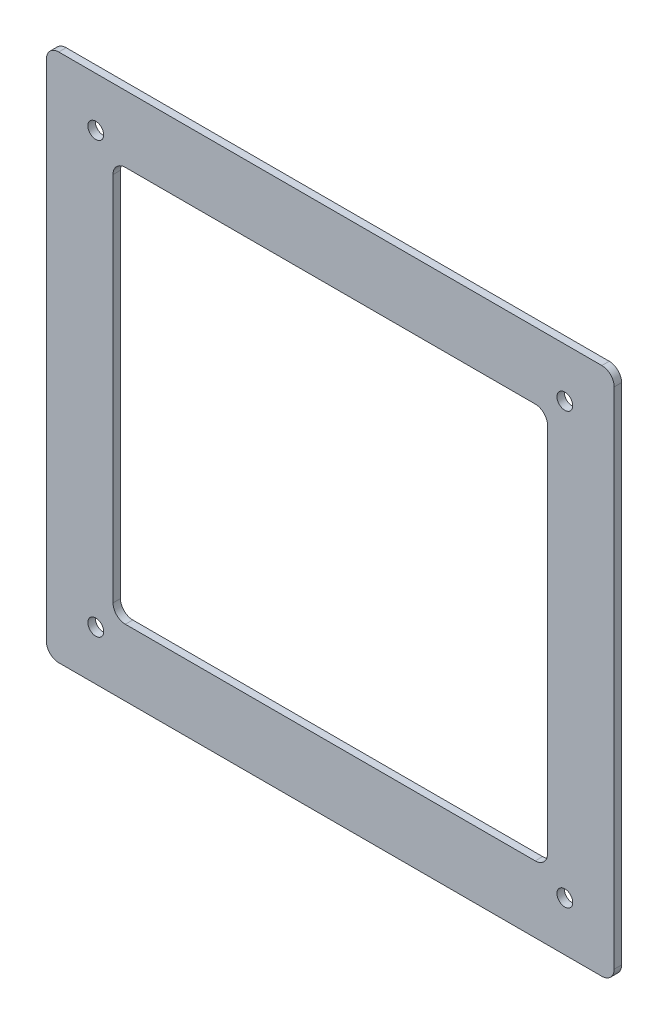
ISO-10303-21;
HEADER;
FILE_DESCRIPTION(('STEP AP214'),'2;1');
FILE_NAME('part.step','',(''),(''),'','','');
FILE_SCHEMA(('AUTOMOTIVE_DESIGN { 1 0 10303 214 1 1 1 1 }'));
ENDSEC;
DATA;
#1=APPLICATION_CONTEXT('core data for automotive mechanical design processes');
#2=APPLICATION_PROTOCOL_DEFINITION('international standard','automotive_design',2000,#1);
#3=PRODUCT_CONTEXT('',#1,'mechanical');
#4=PRODUCT('Part','Part','',(#3));
#5=PRODUCT_RELATED_PRODUCT_CATEGORY('part','',(#4));
#6=PRODUCT_DEFINITION_FORMATION('','',#4);
#7=PRODUCT_DEFINITION_CONTEXT('part definition',#1,'design');
#8=PRODUCT_DEFINITION('design','',#6,#7);
#9=PRODUCT_DEFINITION_SHAPE('','',#8);
#10=(LENGTH_UNIT() NAMED_UNIT(*) SI_UNIT(.MILLI.,.METRE.));
#11=(NAMED_UNIT(*) PLANE_ANGLE_UNIT() SI_UNIT($,.RADIAN.));
#12=(NAMED_UNIT(*) SI_UNIT($,.STERADIAN.) SOLID_ANGLE_UNIT());
#13=UNCERTAINTY_MEASURE_WITH_UNIT(LENGTH_MEASURE(1.E-05),#10,'distance_accuracy_value','');
#14=(GEOMETRIC_REPRESENTATION_CONTEXT(3) GLOBAL_UNCERTAINTY_ASSIGNED_CONTEXT((#13)) GLOBAL_UNIT_ASSIGNED_CONTEXT((#10,
#11,#12)) REPRESENTATION_CONTEXT('',''));
#15=CARTESIAN_POINT('',(0.,0.,0.));
#16=DIRECTION('',(0.,0.,1.));
#17=DIRECTION('',(1.,0.,0.));
#18=AXIS2_PLACEMENT_3D('',#15,#16,#17);
#19=CARTESIAN_POINT('',(0.,0.,3.));
#20=DIRECTION('',(0.,0.,1.));
#21=DIRECTION('',(1.,0.,0.));
#22=AXIS2_PLACEMENT_3D('',#19,#20,#21);
#23=PLANE('',#22);
#24=CARTESIAN_POINT('',(-95.,87.125,3.));
#25=DIRECTION('',(0.,0.,1.));
#26=DIRECTION('',(1.,0.,0.));
#27=AXIS2_PLACEMENT_3D('',#24,#25,#26);
#28=CIRCLE('',#27,3.19999999999999);
#29=CARTESIAN_POINT('',(-91.8,87.125,3.));
#30=VERTEX_POINT('',#29);
#31=EDGE_CURVE('E408',#30,#30,#28,.T.);
#32=ORIENTED_EDGE('',*,*,#31,.F.);
#33=EDGE_LOOP('',(#32));
#34=FACE_BOUND('',#33,.T.);
#35=CARTESIAN_POINT('',(95.,87.125,3.));
#36=DIRECTION('',(0.,0.,1.));
#37=DIRECTION('',(1.,0.,0.));
#38=AXIS2_PLACEMENT_3D('',#35,#36,#37);
#39=CIRCLE('',#38,3.19999999999999);
#40=CARTESIAN_POINT('',(98.2,87.125,3.));
#41=VERTEX_POINT('',#40);
#42=EDGE_CURVE('E403',#41,#41,#39,.T.);
#43=ORIENTED_EDGE('',*,*,#42,.F.);
#44=EDGE_LOOP('',(#43));
#45=FACE_BOUND('',#44,.T.);
#46=CARTESIAN_POINT('',(95.,-87.125,3.));
#47=DIRECTION('',(0.,0.,1.));
#48=DIRECTION('',(1.,0.,0.));
#49=AXIS2_PLACEMENT_3D('',#46,#47,#48);
#50=CIRCLE('',#49,3.19999999999999);
#51=CARTESIAN_POINT('',(98.2,-87.125,3.));
#52=VERTEX_POINT('',#51);
#53=EDGE_CURVE('E397',#52,#52,#50,.T.);
#54=ORIENTED_EDGE('',*,*,#53,.F.);
#55=EDGE_LOOP('',(#54));
#56=FACE_BOUND('',#55,.T.);
#57=CARTESIAN_POINT('',(-95.,-87.125,3.));
#58=DIRECTION('',(0.,0.,1.));
#59=DIRECTION('',(1.,0.,0.));
#60=AXIS2_PLACEMENT_3D('',#57,#58,#59);
#61=CIRCLE('',#60,3.19999999999999);
#62=CARTESIAN_POINT('',(-91.8,-87.125,3.));
#63=VERTEX_POINT('',#62);
#64=EDGE_CURVE('E387',#63,#63,#61,.T.);
#65=ORIENTED_EDGE('',*,*,#64,.F.);
#66=EDGE_LOOP('',(#65));
#67=FACE_BOUND('',#66,.T.);
#68=DIRECTION('',(-1.,0.,0.));
#69=VECTOR('',#68,1.);
#70=CARTESIAN_POINT('',(115.,107.125,3.));
#71=LINE('',#70,#69);
#72=CARTESIAN_POINT('',(110.,107.125,3.));
#73=VERTEX_POINT('',#72);
#74=CARTESIAN_POINT('',(-110.,107.125,3.));
#75=VERTEX_POINT('',#74);
#76=EDGE_CURVE('E170',#73,#75,#71,.T.);
#77=ORIENTED_EDGE('',*,*,#76,.T.);
#78=CARTESIAN_POINT('',(-110.,102.125,3.));
#79=DIRECTION('',(0.,0.,1.));
#80=DIRECTION('',(1.,0.,0.));
#81=AXIS2_PLACEMENT_3D('',#78,#79,#80);
#82=CIRCLE('',#81,5.);
#83=CARTESIAN_POINT('',(-115.,102.125,3.));
#84=VERTEX_POINT('',#83);
#85=EDGE_CURVE('E209',#75,#84,#82,.T.);
#86=ORIENTED_EDGE('',*,*,#85,.T.);
#87=DIRECTION('',(0.,-1.,0.));
#88=VECTOR('',#87,1.);
#89=CARTESIAN_POINT('',(-115.,-107.125,3.));
#90=LINE('',#89,#88);
#91=CARTESIAN_POINT('',(-115.,-102.125,3.));
#92=VERTEX_POINT('',#91);
#93=EDGE_CURVE('E263',#84,#92,#90,.T.);
#94=ORIENTED_EDGE('',*,*,#93,.T.);
#95=CARTESIAN_POINT('',(-110.,-102.125,3.));
#96=DIRECTION('',(0.,0.,1.));
#97=DIRECTION('',(1.,0.,0.));
#98=AXIS2_PLACEMENT_3D('',#95,#96,#97);
#99=CIRCLE('',#98,5.);
#100=CARTESIAN_POINT('',(-110.,-107.125,3.));
#101=VERTEX_POINT('',#100);
#102=EDGE_CURVE('E205',#92,#101,#99,.T.);
#103=ORIENTED_EDGE('',*,*,#102,.T.);
#104=DIRECTION('',(1.,0.,0.));
#105=VECTOR('',#104,1.);
#106=CARTESIAN_POINT('',(115.,-107.125,3.));
#107=LINE('',#106,#105);
#108=CARTESIAN_POINT('',(110.,-107.125,3.));
#109=VERTEX_POINT('',#108);
#110=EDGE_CURVE('E266',#101,#109,#107,.T.);
#111=ORIENTED_EDGE('',*,*,#110,.T.);
#112=CARTESIAN_POINT('',(110.,-102.125,3.));
#113=DIRECTION('',(0.,0.,1.));
#114=DIRECTION('',(1.,0.,0.));
#115=AXIS2_PLACEMENT_3D('',#112,#113,#114);
#116=CIRCLE('',#115,5.);
#117=CARTESIAN_POINT('',(115.,-102.125,3.));
#118=VERTEX_POINT('',#117);
#119=EDGE_CURVE('E207',#109,#118,#116,.T.);
#120=ORIENTED_EDGE('',*,*,#119,.T.);
#121=DIRECTION('',(0.,1.,0.));
#122=VECTOR('',#121,1.);
#123=CARTESIAN_POINT('',(115.,-107.125,3.));
#124=LINE('',#123,#122);
#125=CARTESIAN_POINT('',(115.,102.125,3.));
#126=VERTEX_POINT('',#125);
#127=EDGE_CURVE('E175',#118,#126,#124,.T.);
#128=ORIENTED_EDGE('',*,*,#127,.T.);
#129=CARTESIAN_POINT('',(110.,102.125,3.));
#130=DIRECTION('',(0.,0.,1.));
#131=DIRECTION('',(1.,0.,0.));
#132=AXIS2_PLACEMENT_3D('',#129,#130,#131);
#133=CIRCLE('',#132,5.);
#134=EDGE_CURVE('E203',#126,#73,#133,.T.);
#135=ORIENTED_EDGE('',*,*,#134,.T.);
#136=EDGE_LOOP('',(#77,#86,#94,#103,#111,#120,#128,#135));
#137=FACE_BOUND('',#136,.T.);
#138=DIRECTION('',(1.,0.,0.));
#139=VECTOR('',#138,1.);
#140=CARTESIAN_POINT('',(88.,-80.125,3.));
#141=LINE('',#140,#139);
#142=CARTESIAN_POINT('',(-83.,-80.125,3.));
#143=VERTEX_POINT('',#142);
#144=CARTESIAN_POINT('',(83.,-80.125,3.));
#145=VERTEX_POINT('',#144);
#146=EDGE_CURVE('E251',#143,#145,#141,.T.);
#147=ORIENTED_EDGE('',*,*,#146,.F.);
#148=CARTESIAN_POINT('',(-83.,-75.125,3.));
#149=DIRECTION('',(0.,0.,1.));
#150=DIRECTION('',(1.,0.,0.));
#151=AXIS2_PLACEMENT_3D('',#148,#149,#150);
#152=CIRCLE('',#151,5.);
#153=CARTESIAN_POINT('',(-88.,-75.125,3.));
#154=VERTEX_POINT('',#153);
#155=EDGE_CURVE('E11',#143,#154,#152,.F.);
#156=ORIENTED_EDGE('',*,*,#155,.T.);
#157=DIRECTION('',(0.,-1.,0.));
#158=VECTOR('',#157,1.);
#159=CARTESIAN_POINT('',(-88.,-80.125,3.));
#160=LINE('',#159,#158);
#161=CARTESIAN_POINT('',(-88.,75.125,3.));
#162=VERTEX_POINT('',#161);
#163=EDGE_CURVE('E257',#162,#154,#160,.T.);
#164=ORIENTED_EDGE('',*,*,#163,.F.);
#165=CARTESIAN_POINT('',(-83.,75.125,3.));
#166=DIRECTION('',(0.,0.,1.));
#167=DIRECTION('',(1.,0.,0.));
#168=AXIS2_PLACEMENT_3D('',#165,#166,#167);
#169=CIRCLE('',#168,5.);
#170=CARTESIAN_POINT('',(-83.,80.125,3.));
#171=VERTEX_POINT('',#170);
#172=EDGE_CURVE('E49',#162,#171,#169,.F.);
#173=ORIENTED_EDGE('',*,*,#172,.T.);
#174=DIRECTION('',(-1.,0.,0.));
#175=VECTOR('',#174,1.);
#176=CARTESIAN_POINT('',(88.,80.125,3.));
#177=LINE('',#176,#175);
#178=CARTESIAN_POINT('',(83.,80.125,3.));
#179=VERTEX_POINT('',#178);
#180=EDGE_CURVE('E243',#179,#171,#177,.T.);
#181=ORIENTED_EDGE('',*,*,#180,.F.);
#182=CARTESIAN_POINT('',(83.,75.125,3.));
#183=DIRECTION('',(0.,0.,1.));
#184=DIRECTION('',(1.,0.,0.));
#185=AXIS2_PLACEMENT_3D('',#182,#183,#184);
#186=CIRCLE('',#185,5.);
#187=CARTESIAN_POINT('',(88.,75.125,3.));
#188=VERTEX_POINT('',#187);
#189=EDGE_CURVE('E158',#179,#188,#186,.F.);
#190=ORIENTED_EDGE('',*,*,#189,.T.);
#191=DIRECTION('',(0.,1.,0.));
#192=VECTOR('',#191,1.);
#193=CARTESIAN_POINT('',(88.,-80.125,3.));
#194=LINE('',#193,#192);
#195=CARTESIAN_POINT('',(88.,-75.125,3.));
#196=VERTEX_POINT('',#195);
#197=EDGE_CURVE('E241',#196,#188,#194,.T.);
#198=ORIENTED_EDGE('',*,*,#197,.F.);
#199=CARTESIAN_POINT('',(83.,-75.125,3.));
#200=DIRECTION('',(0.,0.,1.));
#201=DIRECTION('',(1.,0.,0.));
#202=AXIS2_PLACEMENT_3D('',#199,#200,#201);
#203=CIRCLE('',#202,5.);
#204=EDGE_CURVE('E231',#196,#145,#203,.F.);
#205=ORIENTED_EDGE('',*,*,#204,.T.);
#206=EDGE_LOOP('',(#147,#156,#164,#173,#181,#190,#198,#205));
#207=FACE_BOUND('',#206,.T.);
#208=ADVANCED_FACE('F34',(#34,#45,#56,#67,#137,#207),#23,.T.);
#209=CARTESIAN_POINT('',(0.,0.,0.));
#210=DIRECTION('',(0.,0.,1.));
#211=DIRECTION('',(1.,0.,0.));
#212=AXIS2_PLACEMENT_3D('',#209,#210,#211);
#213=PLANE('',#212);
#214=CARTESIAN_POINT('',(-95.,87.125,0.));
#215=DIRECTION('',(0.,0.,1.));
#216=DIRECTION('',(1.,0.,0.));
#217=AXIS2_PLACEMENT_3D('',#214,#215,#216);
#218=CIRCLE('',#217,3.19999999999999);
#219=CARTESIAN_POINT('',(-91.8,87.125,0.));
#220=VERTEX_POINT('',#219);
#221=EDGE_CURVE('E406',#220,#220,#218,.T.);
#222=ORIENTED_EDGE('',*,*,#221,.T.);
#223=EDGE_LOOP('',(#222));
#224=FACE_BOUND('',#223,.T.);
#225=CARTESIAN_POINT('',(95.,87.125,0.));
#226=DIRECTION('',(0.,0.,1.));
#227=DIRECTION('',(1.,0.,0.));
#228=AXIS2_PLACEMENT_3D('',#225,#226,#227);
#229=CIRCLE('',#228,3.19999999999999);
#230=CARTESIAN_POINT('',(98.2,87.125,0.));
#231=VERTEX_POINT('',#230);
#232=EDGE_CURVE('E400',#231,#231,#229,.T.);
#233=ORIENTED_EDGE('',*,*,#232,.T.);
#234=EDGE_LOOP('',(#233));
#235=FACE_BOUND('',#234,.T.);
#236=CARTESIAN_POINT('',(95.,-87.125,0.));
#237=DIRECTION('',(0.,0.,1.));
#238=DIRECTION('',(1.,0.,0.));
#239=AXIS2_PLACEMENT_3D('',#236,#237,#238);
#240=CIRCLE('',#239,3.19999999999999);
#241=CARTESIAN_POINT('',(98.2,-87.125,0.));
#242=VERTEX_POINT('',#241);
#243=EDGE_CURVE('E394',#242,#242,#240,.T.);
#244=ORIENTED_EDGE('',*,*,#243,.T.);
#245=EDGE_LOOP('',(#244));
#246=FACE_BOUND('',#245,.T.);
#247=CARTESIAN_POINT('',(-95.,-87.125,0.));
#248=DIRECTION('',(0.,0.,1.));
#249=DIRECTION('',(1.,0.,0.));
#250=AXIS2_PLACEMENT_3D('',#247,#248,#249);
#251=CIRCLE('',#250,3.19999999999999);
#252=CARTESIAN_POINT('',(-91.8,-87.125,0.));
#253=VERTEX_POINT('',#252);
#254=EDGE_CURVE('E384',#253,#253,#251,.T.);
#255=ORIENTED_EDGE('',*,*,#254,.T.);
#256=EDGE_LOOP('',(#255));
#257=FACE_BOUND('',#256,.T.);
#258=DIRECTION('',(0.,-1.,0.));
#259=VECTOR('',#258,1.);
#260=CARTESIAN_POINT('',(-115.,-107.125,0.));
#261=LINE('',#260,#259);
#262=CARTESIAN_POINT('',(-115.,102.125,0.));
#263=VERTEX_POINT('',#262);
#264=CARTESIAN_POINT('',(-115.,-102.125,0.));
#265=VERTEX_POINT('',#264);
#266=EDGE_CURVE('E271',#263,#265,#261,.T.);
#267=ORIENTED_EDGE('',*,*,#266,.F.);
#268=CARTESIAN_POINT('',(-110.,102.125,0.));
#269=DIRECTION('',(0.,0.,1.));
#270=DIRECTION('',(1.,0.,0.));
#271=AXIS2_PLACEMENT_3D('',#268,#269,#270);
#272=CIRCLE('',#271,5.);
#273=CARTESIAN_POINT('',(-110.,107.125,0.));
#274=VERTEX_POINT('',#273);
#275=EDGE_CURVE('E196',#263,#274,#272,.F.);
#276=ORIENTED_EDGE('',*,*,#275,.T.);
#277=DIRECTION('',(-1.,0.,0.));
#278=VECTOR('',#277,1.);
#279=CARTESIAN_POINT('',(115.,107.125,0.));
#280=LINE('',#279,#278);
#281=CARTESIAN_POINT('',(110.,107.125,0.));
#282=VERTEX_POINT('',#281);
#283=EDGE_CURVE('E178',#282,#274,#280,.T.);
#284=ORIENTED_EDGE('',*,*,#283,.F.);
#285=CARTESIAN_POINT('',(110.,102.125,0.));
#286=DIRECTION('',(0.,0.,1.));
#287=DIRECTION('',(1.,0.,0.));
#288=AXIS2_PLACEMENT_3D('',#285,#286,#287);
#289=CIRCLE('',#288,5.);
#290=CARTESIAN_POINT('',(115.,102.125,0.));
#291=VERTEX_POINT('',#290);
#292=EDGE_CURVE('E190',#282,#291,#289,.F.);
#293=ORIENTED_EDGE('',*,*,#292,.T.);
#294=DIRECTION('',(0.,1.,0.));
#295=VECTOR('',#294,1.);
#296=CARTESIAN_POINT('',(115.,-107.125,0.));
#297=LINE('',#296,#295);
#298=CARTESIAN_POINT('',(115.,-102.125,0.));
#299=VERTEX_POINT('',#298);
#300=EDGE_CURVE('E276',#299,#291,#297,.T.);
#301=ORIENTED_EDGE('',*,*,#300,.F.);
#302=CARTESIAN_POINT('',(110.,-102.125,0.));
#303=DIRECTION('',(0.,0.,1.));
#304=DIRECTION('',(1.,0.,0.));
#305=AXIS2_PLACEMENT_3D('',#302,#303,#304);
#306=CIRCLE('',#305,5.);
#307=CARTESIAN_POINT('',(110.,-107.125,0.));
#308=VERTEX_POINT('',#307);
#309=EDGE_CURVE('E194',#299,#308,#306,.F.);
#310=ORIENTED_EDGE('',*,*,#309,.T.);
#311=DIRECTION('',(1.,0.,0.));
#312=VECTOR('',#311,1.);
#313=CARTESIAN_POINT('',(115.,-107.125,0.));
#314=LINE('',#313,#312);
#315=CARTESIAN_POINT('',(-110.,-107.125,0.));
#316=VERTEX_POINT('',#315);
#317=EDGE_CURVE('E274',#316,#308,#314,.T.);
#318=ORIENTED_EDGE('',*,*,#317,.F.);
#319=CARTESIAN_POINT('',(-110.,-102.125,0.));
#320=DIRECTION('',(0.,0.,1.));
#321=DIRECTION('',(1.,0.,0.));
#322=AXIS2_PLACEMENT_3D('',#319,#320,#321);
#323=CIRCLE('',#322,5.);
#324=EDGE_CURVE('E192',#316,#265,#323,.F.);
#325=ORIENTED_EDGE('',*,*,#324,.T.);
#326=EDGE_LOOP('',(#267,#276,#284,#293,#301,#310,#318,#325));
#327=FACE_BOUND('',#326,.T.);
#328=DIRECTION('',(-1.,0.,0.));
#329=VECTOR('',#328,1.);
#330=CARTESIAN_POINT('',(88.,80.125,0.));
#331=LINE('',#330,#329);
#332=CARTESIAN_POINT('',(83.,80.125,0.));
#333=VERTEX_POINT('',#332);
#334=CARTESIAN_POINT('',(-83.,80.125,0.));
#335=VERTEX_POINT('',#334);
#336=EDGE_CURVE('E254',#333,#335,#331,.T.);
#337=ORIENTED_EDGE('',*,*,#336,.T.);
#338=CARTESIAN_POINT('',(-83.,75.125,0.));
#339=DIRECTION('',(0.,0.,1.));
#340=DIRECTION('',(1.,0.,0.));
#341=AXIS2_PLACEMENT_3D('',#338,#339,#340);
#342=CIRCLE('',#341,5.);
#343=CARTESIAN_POINT('',(-88.,75.125,0.));
#344=VERTEX_POINT('',#343);
#345=EDGE_CURVE('E233',#335,#344,#342,.T.);
#346=ORIENTED_EDGE('',*,*,#345,.T.);
#347=DIRECTION('',(0.,-1.,0.));
#348=VECTOR('',#347,1.);
#349=CARTESIAN_POINT('',(-88.,-80.125,0.));
#350=LINE('',#349,#348);
#351=CARTESIAN_POINT('',(-88.,-75.125,0.));
#352=VERTEX_POINT('',#351);
#353=EDGE_CURVE('E153',#344,#352,#350,.T.);
#354=ORIENTED_EDGE('',*,*,#353,.T.);
#355=CARTESIAN_POINT('',(-83.,-75.125,0.));
#356=DIRECTION('',(0.,0.,1.));
#357=DIRECTION('',(1.,0.,0.));
#358=AXIS2_PLACEMENT_3D('',#355,#356,#357);
#359=CIRCLE('',#358,5.);
#360=CARTESIAN_POINT('',(-83.,-80.125,0.));
#361=VERTEX_POINT('',#360);
#362=EDGE_CURVE('E42',#352,#361,#359,.T.);
#363=ORIENTED_EDGE('',*,*,#362,.T.);
#364=DIRECTION('',(1.,0.,0.));
#365=VECTOR('',#364,1.);
#366=CARTESIAN_POINT('',(88.,-80.125,0.));
#367=LINE('',#366,#365);
#368=CARTESIAN_POINT('',(83.,-80.125,0.));
#369=VERTEX_POINT('',#368);
#370=EDGE_CURVE('E151',#361,#369,#367,.T.);
#371=ORIENTED_EDGE('',*,*,#370,.T.);
#372=CARTESIAN_POINT('',(83.,-75.125,0.));
#373=DIRECTION('',(0.,0.,1.));
#374=DIRECTION('',(1.,0.,0.));
#375=AXIS2_PLACEMENT_3D('',#372,#373,#374);
#376=CIRCLE('',#375,5.);
#377=CARTESIAN_POINT('',(88.,-75.125,0.));
#378=VERTEX_POINT('',#377);
#379=EDGE_CURVE('E229',#369,#378,#376,.T.);
#380=ORIENTED_EDGE('',*,*,#379,.T.);
#381=DIRECTION('',(0.,1.,0.));
#382=VECTOR('',#381,1.);
#383=CARTESIAN_POINT('',(88.,-80.125,0.));
#384=LINE('',#383,#382);
#385=CARTESIAN_POINT('',(88.,75.125,0.));
#386=VERTEX_POINT('',#385);
#387=EDGE_CURVE('E167',#378,#386,#384,.T.);
#388=ORIENTED_EDGE('',*,*,#387,.T.);
#389=CARTESIAN_POINT('',(83.,75.125,0.));
#390=DIRECTION('',(0.,0.,1.));
#391=DIRECTION('',(1.,0.,0.));
#392=AXIS2_PLACEMENT_3D('',#389,#390,#391);
#393=CIRCLE('',#392,5.);
#394=EDGE_CURVE('E236',#386,#333,#393,.T.);
#395=ORIENTED_EDGE('',*,*,#394,.T.);
#396=EDGE_LOOP('',(#337,#346,#354,#363,#371,#380,#388,#395));
#397=FACE_BOUND('',#396,.T.);
#398=ADVANCED_FACE('F150',(#224,#235,#246,#257,#327,#397),#213,.F.);
#399=CARTESIAN_POINT('',(-115.,-107.125,3.));
#400=DIRECTION('',(1.,0.,0.));
#401=DIRECTION('',(0.,0.,-1.));
#402=AXIS2_PLACEMENT_3D('',#399,#400,#401);
#403=PLANE('',#402);
#404=ORIENTED_EDGE('',*,*,#93,.F.);
#405=DIRECTION('',(0.,0.,-1.));
#406=VECTOR('',#405,1.);
#407=CARTESIAN_POINT('',(-115.,102.125,3.));
#408=LINE('',#407,#406);
#409=EDGE_CURVE('E187',#84,#263,#408,.T.);
#410=ORIENTED_EDGE('',*,*,#409,.T.);
#411=ORIENTED_EDGE('',*,*,#266,.T.);
#412=DIRECTION('',(0.,0.,-1.));
#413=VECTOR('',#412,1.);
#414=CARTESIAN_POINT('',(-115.,-102.125,3.));
#415=LINE('',#414,#413);
#416=EDGE_CURVE('E185',#265,#92,#415,.F.);
#417=ORIENTED_EDGE('',*,*,#416,.T.);
#418=EDGE_LOOP('',(#404,#410,#411,#417));
#419=FACE_BOUND('',#418,.T.);
#420=ADVANCED_FACE('F297',(#419),#403,.F.);
#421=CARTESIAN_POINT('',(115.,-107.125,3.));
#422=DIRECTION('',(0.,1.,0.));
#423=DIRECTION('',(0.,0.,1.));
#424=AXIS2_PLACEMENT_3D('',#421,#422,#423);
#425=PLANE('',#424);
#426=ORIENTED_EDGE('',*,*,#317,.T.);
#427=DIRECTION('',(0.,0.,-1.));
#428=VECTOR('',#427,1.);
#429=CARTESIAN_POINT('',(110.,-107.125,3.));
#430=LINE('',#429,#428);
#431=EDGE_CURVE('E227',#308,#109,#430,.F.);
#432=ORIENTED_EDGE('',*,*,#431,.T.);
#433=ORIENTED_EDGE('',*,*,#110,.F.);
#434=DIRECTION('',(0.,0.,-1.));
#435=VECTOR('',#434,1.);
#436=CARTESIAN_POINT('',(-110.,-107.125,3.));
#437=LINE('',#436,#435);
#438=EDGE_CURVE('E224',#101,#316,#437,.T.);
#439=ORIENTED_EDGE('',*,*,#438,.T.);
#440=EDGE_LOOP('',(#426,#432,#433,#439));
#441=FACE_BOUND('',#440,.T.);
#442=ADVANCED_FACE('F306',(#441),#425,.F.);
#443=CARTESIAN_POINT('',(115.,-107.125,3.));
#444=DIRECTION('',(-1.,0.,0.));
#445=DIRECTION('',(0.,0.,1.));
#446=AXIS2_PLACEMENT_3D('',#443,#444,#445);
#447=PLANE('',#446);
#448=ORIENTED_EDGE('',*,*,#127,.F.);
#449=DIRECTION('',(0.,0.,-1.));
#450=VECTOR('',#449,1.);
#451=CARTESIAN_POINT('',(115.,-102.125,3.));
#452=LINE('',#451,#450);
#453=EDGE_CURVE('E221',#118,#299,#452,.T.);
#454=ORIENTED_EDGE('',*,*,#453,.T.);
#455=ORIENTED_EDGE('',*,*,#300,.T.);
#456=DIRECTION('',(0.,0.,-1.));
#457=VECTOR('',#456,1.);
#458=CARTESIAN_POINT('',(115.,102.125,3.));
#459=LINE('',#458,#457);
#460=EDGE_CURVE('E219',#291,#126,#459,.F.);
#461=ORIENTED_EDGE('',*,*,#460,.T.);
#462=EDGE_LOOP('',(#448,#454,#455,#461));
#463=FACE_BOUND('',#462,.T.);
#464=ADVANCED_FACE('F314',(#463),#447,.F.);
#465=CARTESIAN_POINT('',(115.,107.125,3.));
#466=DIRECTION('',(0.,-1.,0.));
#467=DIRECTION('',(0.,0.,-1.));
#468=AXIS2_PLACEMENT_3D('',#465,#466,#467);
#469=PLANE('',#468);
#470=ORIENTED_EDGE('',*,*,#283,.T.);
#471=DIRECTION('',(0.,0.,-1.));
#472=VECTOR('',#471,1.);
#473=CARTESIAN_POINT('',(-110.,107.125,3.));
#474=LINE('',#473,#472);
#475=EDGE_CURVE('E201',#274,#75,#474,.F.);
#476=ORIENTED_EDGE('',*,*,#475,.T.);
#477=ORIENTED_EDGE('',*,*,#76,.F.);
#478=DIRECTION('',(0.,0.,-1.));
#479=VECTOR('',#478,1.);
#480=CARTESIAN_POINT('',(110.,107.125,3.));
#481=LINE('',#480,#479);
#482=EDGE_CURVE('E198',#73,#282,#481,.T.);
#483=ORIENTED_EDGE('',*,*,#482,.T.);
#484=EDGE_LOOP('',(#470,#476,#477,#483));
#485=FACE_BOUND('',#484,.T.);
#486=ADVANCED_FACE('F285',(#485),#469,.F.);
#487=CARTESIAN_POINT('',(-88.,-80.125,3.));
#488=DIRECTION('',(1.,0.,0.));
#489=DIRECTION('',(0.,0.,-1.));
#490=AXIS2_PLACEMENT_3D('',#487,#488,#489);
#491=PLANE('',#490);
#492=ORIENTED_EDGE('',*,*,#353,.F.);
#493=DIRECTION('',(0.,0.,-1.));
#494=VECTOR('',#493,1.);
#495=CARTESIAN_POINT('',(-88.,75.125,3.));
#496=LINE('',#495,#494);
#497=EDGE_CURVE('E217',#344,#162,#496,.F.);
#498=ORIENTED_EDGE('',*,*,#497,.T.);
#499=ORIENTED_EDGE('',*,*,#163,.T.);
#500=DIRECTION('',(0.,0.,-1.));
#501=VECTOR('',#500,1.);
#502=CARTESIAN_POINT('',(-88.,-75.125,0.));
#503=LINE('',#502,#501);
#504=EDGE_CURVE('E215',#154,#352,#503,.T.);
#505=ORIENTED_EDGE('',*,*,#504,.T.);
#506=EDGE_LOOP('',(#492,#498,#499,#505));
#507=FACE_BOUND('',#506,.T.);
#508=ADVANCED_FACE('F333',(#507),#491,.T.);
#509=CARTESIAN_POINT('',(88.,-80.125,3.));
#510=DIRECTION('',(0.,1.,0.));
#511=DIRECTION('',(-1.,0.,0.));
#512=AXIS2_PLACEMENT_3D('',#509,#510,#511);
#513=PLANE('',#512);
#514=ORIENTED_EDGE('',*,*,#146,.T.);
#515=DIRECTION('',(0.,0.,-1.));
#516=VECTOR('',#515,1.);
#517=CARTESIAN_POINT('',(83.,-80.125,0.));
#518=LINE('',#517,#516);
#519=EDGE_CURVE('E166',#145,#369,#518,.T.);
#520=ORIENTED_EDGE('',*,*,#519,.T.);
#521=ORIENTED_EDGE('',*,*,#370,.F.);
#522=DIRECTION('',(0.,0.,-1.));
#523=VECTOR('',#522,1.);
#524=CARTESIAN_POINT('',(-83.,-80.125,3.));
#525=LINE('',#524,#523);
#526=EDGE_CURVE('E163',#361,#143,#525,.F.);
#527=ORIENTED_EDGE('',*,*,#526,.T.);
#528=EDGE_LOOP('',(#514,#520,#521,#527));
#529=FACE_BOUND('',#528,.T.);
#530=ADVANCED_FACE('F162',(#529),#513,.T.);
#531=CARTESIAN_POINT('',(88.,-80.125,3.));
#532=DIRECTION('',(-1.,0.,0.));
#533=DIRECTION('',(0.,0.,1.));
#534=AXIS2_PLACEMENT_3D('',#531,#532,#533);
#535=PLANE('',#534);
#536=ORIENTED_EDGE('',*,*,#387,.F.);
#537=DIRECTION('',(0.,0.,-1.));
#538=VECTOR('',#537,1.);
#539=CARTESIAN_POINT('',(88.,-75.125,3.));
#540=LINE('',#539,#538);
#541=EDGE_CURVE('E183',#378,#196,#540,.F.);
#542=ORIENTED_EDGE('',*,*,#541,.T.);
#543=ORIENTED_EDGE('',*,*,#197,.T.);
#544=DIRECTION('',(0.,0.,-1.));
#545=VECTOR('',#544,1.);
#546=CARTESIAN_POINT('',(88.,75.125,0.));
#547=LINE('',#546,#545);
#548=EDGE_CURVE('E172',#188,#386,#547,.T.);
#549=ORIENTED_EDGE('',*,*,#548,.T.);
#550=EDGE_LOOP('',(#536,#542,#543,#549));
#551=FACE_BOUND('',#550,.T.);
#552=ADVANCED_FACE('F248',(#551),#535,.T.);
#553=CARTESIAN_POINT('',(88.,80.125,3.));
#554=DIRECTION('',(0.,-1.,0.));
#555=DIRECTION('',(0.,0.,-1.));
#556=AXIS2_PLACEMENT_3D('',#553,#554,#555);
#557=PLANE('',#556);
#558=ORIENTED_EDGE('',*,*,#180,.T.);
#559=DIRECTION('',(0.,0.,-1.));
#560=VECTOR('',#559,1.);
#561=CARTESIAN_POINT('',(-83.,80.125,0.));
#562=LINE('',#561,#560);
#563=EDGE_CURVE('E212',#171,#335,#562,.T.);
#564=ORIENTED_EDGE('',*,*,#563,.T.);
#565=ORIENTED_EDGE('',*,*,#336,.F.);
#566=DIRECTION('',(0.,0.,-1.));
#567=VECTOR('',#566,1.);
#568=CARTESIAN_POINT('',(83.,80.125,3.));
#569=LINE('',#568,#567);
#570=EDGE_CURVE('E56',#333,#179,#569,.F.);
#571=ORIENTED_EDGE('',*,*,#570,.T.);
#572=EDGE_LOOP('',(#558,#564,#565,#571));
#573=FACE_BOUND('',#572,.T.);
#574=ADVANCED_FACE('F255',(#573),#557,.T.);
#575=CARTESIAN_POINT('',(83.,-75.125,3.));
#576=DIRECTION('',(0.,0.,1.));
#577=DIRECTION('',(1.,0.,0.));
#578=AXIS2_PLACEMENT_3D('',#575,#576,#577);
#579=CYLINDRICAL_SURFACE('',#578,5.);
#580=ORIENTED_EDGE('',*,*,#204,.F.);
#581=ORIENTED_EDGE('',*,*,#541,.F.);
#582=ORIENTED_EDGE('',*,*,#379,.F.);
#583=ORIENTED_EDGE('',*,*,#519,.F.);
#584=EDGE_LOOP('',(#580,#581,#582,#583));
#585=FACE_BOUND('',#584,.T.);
#586=ADVANCED_FACE('F338',(#585),#579,.F.);
#587=CARTESIAN_POINT('',(-110.,102.125,3.));
#588=DIRECTION('',(0.,0.,-1.));
#589=DIRECTION('',(-1.,0.,0.));
#590=AXIS2_PLACEMENT_3D('',#587,#588,#589);
#591=CYLINDRICAL_SURFACE('',#590,5.);
#592=ORIENTED_EDGE('',*,*,#85,.F.);
#593=ORIENTED_EDGE('',*,*,#475,.F.);
#594=ORIENTED_EDGE('',*,*,#275,.F.);
#595=ORIENTED_EDGE('',*,*,#409,.F.);
#596=EDGE_LOOP('',(#592,#593,#594,#595));
#597=FACE_BOUND('',#596,.T.);
#598=ADVANCED_FACE('F291',(#597),#591,.T.);
#599=CARTESIAN_POINT('',(-83.,75.125,3.));
#600=DIRECTION('',(0.,0.,1.));
#601=DIRECTION('',(1.,0.,0.));
#602=AXIS2_PLACEMENT_3D('',#599,#600,#601);
#603=CYLINDRICAL_SURFACE('',#602,5.);
#604=ORIENTED_EDGE('',*,*,#172,.F.);
#605=ORIENTED_EDGE('',*,*,#497,.F.);
#606=ORIENTED_EDGE('',*,*,#345,.F.);
#607=ORIENTED_EDGE('',*,*,#563,.F.);
#608=EDGE_LOOP('',(#604,#605,#606,#607));
#609=FACE_BOUND('',#608,.T.);
#610=ADVANCED_FACE('F344',(#609),#603,.F.);
#611=CARTESIAN_POINT('',(110.,-102.125,3.));
#612=DIRECTION('',(0.,0.,-1.));
#613=DIRECTION('',(-1.,0.,0.));
#614=AXIS2_PLACEMENT_3D('',#611,#612,#613);
#615=CYLINDRICAL_SURFACE('',#614,5.);
#616=ORIENTED_EDGE('',*,*,#119,.F.);
#617=ORIENTED_EDGE('',*,*,#431,.F.);
#618=ORIENTED_EDGE('',*,*,#309,.F.);
#619=ORIENTED_EDGE('',*,*,#453,.F.);
#620=EDGE_LOOP('',(#616,#617,#618,#619));
#621=FACE_BOUND('',#620,.T.);
#622=ADVANCED_FACE('F310',(#621),#615,.T.);
#623=CARTESIAN_POINT('',(-110.,-102.125,3.));
#624=DIRECTION('',(0.,0.,-1.));
#625=DIRECTION('',(-1.,0.,0.));
#626=AXIS2_PLACEMENT_3D('',#623,#624,#625);
#627=CYLINDRICAL_SURFACE('',#626,5.);
#628=ORIENTED_EDGE('',*,*,#102,.F.);
#629=ORIENTED_EDGE('',*,*,#416,.F.);
#630=ORIENTED_EDGE('',*,*,#324,.F.);
#631=ORIENTED_EDGE('',*,*,#438,.F.);
#632=EDGE_LOOP('',(#628,#629,#630,#631));
#633=FACE_BOUND('',#632,.T.);
#634=ADVANCED_FACE('F301',(#633),#627,.T.);
#635=CARTESIAN_POINT('',(83.,75.125,3.));
#636=DIRECTION('',(0.,0.,1.));
#637=DIRECTION('',(1.,0.,0.));
#638=AXIS2_PLACEMENT_3D('',#635,#636,#637);
#639=CYLINDRICAL_SURFACE('',#638,5.);
#640=ORIENTED_EDGE('',*,*,#189,.F.);
#641=ORIENTED_EDGE('',*,*,#570,.F.);
#642=ORIENTED_EDGE('',*,*,#394,.F.);
#643=ORIENTED_EDGE('',*,*,#548,.F.);
#644=EDGE_LOOP('',(#640,#641,#642,#643));
#645=FACE_BOUND('',#644,.T.);
#646=ADVANCED_FACE('F253',(#645),#639,.F.);
#647=CARTESIAN_POINT('',(110.,102.125,3.));
#648=DIRECTION('',(0.,0.,-1.));
#649=DIRECTION('',(-1.,0.,0.));
#650=AXIS2_PLACEMENT_3D('',#647,#648,#649);
#651=CYLINDRICAL_SURFACE('',#650,5.);
#652=ORIENTED_EDGE('',*,*,#134,.F.);
#653=ORIENTED_EDGE('',*,*,#460,.F.);
#654=ORIENTED_EDGE('',*,*,#292,.F.);
#655=ORIENTED_EDGE('',*,*,#482,.F.);
#656=EDGE_LOOP('',(#652,#653,#654,#655));
#657=FACE_BOUND('',#656,.T.);
#658=ADVANCED_FACE('F316',(#657),#651,.T.);
#659=CARTESIAN_POINT('',(-83.,-75.125,3.));
#660=DIRECTION('',(0.,0.,1.));
#661=DIRECTION('',(1.,0.,0.));
#662=AXIS2_PLACEMENT_3D('',#659,#660,#661);
#663=CYLINDRICAL_SURFACE('',#662,5.);
#664=ORIENTED_EDGE('',*,*,#155,.F.);
#665=ORIENTED_EDGE('',*,*,#526,.F.);
#666=ORIENTED_EDGE('',*,*,#362,.F.);
#667=ORIENTED_EDGE('',*,*,#504,.F.);
#668=EDGE_LOOP('',(#664,#665,#666,#667));
#669=FACE_BOUND('',#668,.T.);
#670=ADVANCED_FACE('F36',(#669),#663,.F.);
#671=CARTESIAN_POINT('',(-95.,-87.125,3.));
#672=DIRECTION('',(0.,0.,1.));
#673=DIRECTION('',(1.,0.,0.));
#674=AXIS2_PLACEMENT_3D('',#671,#672,#673);
#675=CYLINDRICAL_SURFACE('',#674,3.19999999999999);
#676=ORIENTED_EDGE('',*,*,#254,.F.);
#677=EDGE_LOOP('',(#676));
#678=FACE_BOUND('',#677,.T.);
#679=ORIENTED_EDGE('',*,*,#64,.T.);
#680=EDGE_LOOP('',(#679));
#681=FACE_BOUND('',#680,.T.);
#682=ADVANCED_FACE('F357',(#678,#681),#675,.F.);
#683=CARTESIAN_POINT('',(95.,-87.125,3.));
#684=DIRECTION('',(0.,0.,1.));
#685=DIRECTION('',(1.,0.,0.));
#686=AXIS2_PLACEMENT_3D('',#683,#684,#685);
#687=CYLINDRICAL_SURFACE('',#686,3.19999999999999);
#688=ORIENTED_EDGE('',*,*,#243,.F.);
#689=EDGE_LOOP('',(#688));
#690=FACE_BOUND('',#689,.T.);
#691=ORIENTED_EDGE('',*,*,#53,.T.);
#692=EDGE_LOOP('',(#691));
#693=FACE_BOUND('',#692,.T.);
#694=ADVANCED_FACE('F361',(#690,#693),#687,.F.);
#695=CARTESIAN_POINT('',(95.,87.125,3.));
#696=DIRECTION('',(0.,0.,1.));
#697=DIRECTION('',(1.,0.,0.));
#698=AXIS2_PLACEMENT_3D('',#695,#696,#697);
#699=CYLINDRICAL_SURFACE('',#698,3.19999999999999);
#700=ORIENTED_EDGE('',*,*,#232,.F.);
#701=EDGE_LOOP('',(#700));
#702=FACE_BOUND('',#701,.T.);
#703=ORIENTED_EDGE('',*,*,#42,.T.);
#704=EDGE_LOOP('',(#703));
#705=FACE_BOUND('',#704,.T.);
#706=ADVANCED_FACE('F367',(#702,#705),#699,.F.);
#707=CARTESIAN_POINT('',(-95.,87.125,3.));
#708=DIRECTION('',(0.,0.,1.));
#709=DIRECTION('',(1.,0.,0.));
#710=AXIS2_PLACEMENT_3D('',#707,#708,#709);
#711=CYLINDRICAL_SURFACE('',#710,3.19999999999999);
#712=ORIENTED_EDGE('',*,*,#221,.F.);
#713=EDGE_LOOP('',(#712));
#714=FACE_BOUND('',#713,.T.);
#715=ORIENTED_EDGE('',*,*,#31,.T.);
#716=EDGE_LOOP('',(#715));
#717=FACE_BOUND('',#716,.T.);
#718=ADVANCED_FACE('F412',(#714,#717),#711,.F.);
#719=CLOSED_SHELL('',(#208,#398,#420,#442,#464,#486,#508,#530,#552,#574,#586,#598,#610,#622,
#634,#646,#658,#670,#682,#694,#706,#718));
#720=MANIFOLD_SOLID_BREP('B2',#719);
#721=ADVANCED_BREP_SHAPE_REPRESENTATION('',(#18,#720),#14);
#722=SHAPE_DEFINITION_REPRESENTATION(#9,#721);
ENDSEC;
END-ISO-10303-21;
